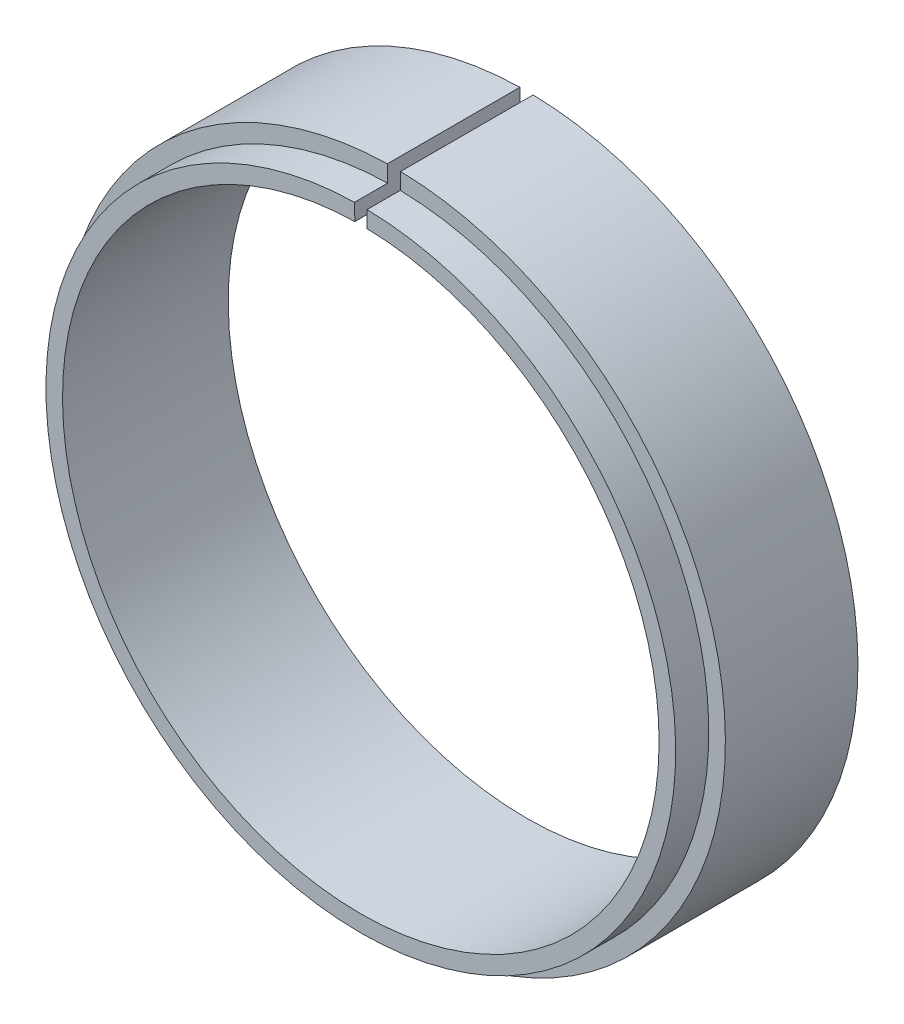
ISO-10303-21;
HEADER;
FILE_DESCRIPTION(('STEP AP214'),'2;1');
FILE_NAME('part.step','',(''),(''),'','','');
FILE_SCHEMA(('AUTOMOTIVE_DESIGN { 1 0 10303 214 1 1 1 1 }'));
ENDSEC;
DATA;
#1=APPLICATION_CONTEXT('core data for automotive mechanical design processes');
#2=APPLICATION_PROTOCOL_DEFINITION('international standard','automotive_design',2000,#1);
#3=PRODUCT_CONTEXT('',#1,'mechanical');
#4=PRODUCT('Part','Part','',(#3));
#5=PRODUCT_RELATED_PRODUCT_CATEGORY('part','',(#4));
#6=PRODUCT_DEFINITION_FORMATION('','',#4);
#7=PRODUCT_DEFINITION_CONTEXT('part definition',#1,'design');
#8=PRODUCT_DEFINITION('design','',#6,#7);
#9=PRODUCT_DEFINITION_SHAPE('','',#8);
#10=(LENGTH_UNIT() NAMED_UNIT(*) SI_UNIT(.MILLI.,.METRE.));
#11=(NAMED_UNIT(*) PLANE_ANGLE_UNIT() SI_UNIT($,.RADIAN.));
#12=(NAMED_UNIT(*) SI_UNIT($,.STERADIAN.) SOLID_ANGLE_UNIT());
#13=UNCERTAINTY_MEASURE_WITH_UNIT(LENGTH_MEASURE(1.E-05),#10,'distance_accuracy_value','');
#14=(GEOMETRIC_REPRESENTATION_CONTEXT(3) GLOBAL_UNCERTAINTY_ASSIGNED_CONTEXT((#13)) GLOBAL_UNIT_ASSIGNED_CONTEXT((#10,
#11,#12)) REPRESENTATION_CONTEXT('',''));
#15=CARTESIAN_POINT('',(0.,0.,0.));
#16=DIRECTION('',(0.,0.,1.));
#17=DIRECTION('',(1.,0.,0.));
#18=AXIS2_PLACEMENT_3D('',#15,#16,#17);
#19=CARTESIAN_POINT('',(0.,0.,20.));
#20=DIRECTION('',(0.,0.,-1.));
#21=DIRECTION('',(-1.,0.,0.));
#22=AXIS2_PLACEMENT_3D('',#19,#20,#21);
#23=CYLINDRICAL_SURFACE('',#22,45.);
#24=CARTESIAN_POINT('',(0.,0.,0.));
#25=DIRECTION('',(0.,0.,1.));
#26=DIRECTION('',(1.,0.,0.));
#27=AXIS2_PLACEMENT_3D('',#24,#25,#26);
#28=CIRCLE('',#27,45.);
#29=CARTESIAN_POINT('',(0.899999999999999,44.99099909982,0.));
#30=VERTEX_POINT('',#29);
#31=CARTESIAN_POINT('',(-0.899999999999983,44.99099909982,0.));
#32=VERTEX_POINT('',#31);
#33=EDGE_CURVE('E84',#30,#32,#28,.F.);
#34=ORIENTED_EDGE('',*,*,#33,.T.);
#35=DIRECTION('',(0.,0.,-1.));
#36=VECTOR('',#35,1.);
#37=CARTESIAN_POINT('',(-0.899999999999983,44.99099909982,20.));
#38=LINE('',#37,#36);
#39=CARTESIAN_POINT('',(-0.899999999999983,44.99099909982,25.));
#40=VERTEX_POINT('',#39);
#41=EDGE_CURVE('E11',#40,#32,#38,.T.);
#42=ORIENTED_EDGE('',*,*,#41,.F.);
#43=CARTESIAN_POINT('',(0.,0.,25.));
#44=DIRECTION('',(0.,0.,-1.));
#45=DIRECTION('',(1.,0.,0.));
#46=AXIS2_PLACEMENT_3D('',#43,#44,#45);
#47=CIRCLE('',#46,45.);
#48=CARTESIAN_POINT('',(0.899999999999999,44.99099909982,25.));
#49=VERTEX_POINT('',#48);
#50=EDGE_CURVE('E87',#49,#40,#47,.T.);
#51=ORIENTED_EDGE('',*,*,#50,.F.);
#52=DIRECTION('',(0.,0.,-1.));
#53=VECTOR('',#52,1.);
#54=CARTESIAN_POINT('',(0.899999999999999,44.99099909982,20.));
#55=LINE('',#54,#53);
#56=EDGE_CURVE('E81',#49,#30,#55,.T.);
#57=ORIENTED_EDGE('',*,*,#56,.T.);
#58=EDGE_LOOP('',(#34,#42,#51,#57));
#59=FACE_BOUND('',#58,.T.);
#60=ADVANCED_FACE('F38',(#59),#23,.F.);
#61=CARTESIAN_POINT('',(-0.999999999999976,49.9899989998,20.));
#62=DIRECTION('',(0.999799979995999,0.0199999999999986,0.));
#63=DIRECTION('',(-0.0199999999999986,0.999799979995999,0.));
#64=AXIS2_PLACEMENT_3D('',#61,#62,#63);
#65=PLANE('',#64);
#66=DIRECTION('',(0.0199999999999986,-0.999799979995999,0.));
#67=VECTOR('',#66,1.);
#68=CARTESIAN_POINT('',(-0.999999999999976,49.9899989998,0.));
#69=LINE('',#68,#67);
#70=CARTESIAN_POINT('',(-0.999999999999976,49.9899989998,0.));
#71=VERTEX_POINT('',#70);
#72=EDGE_CURVE('E99',#71,#32,#69,.T.);
#73=ORIENTED_EDGE('',*,*,#72,.F.);
#74=DIRECTION('',(0.,0.,-1.));
#75=VECTOR('',#74,1.);
#76=CARTESIAN_POINT('',(-0.999999999999976,49.9899989998,20.));
#77=LINE('',#76,#75);
#78=CARTESIAN_POINT('',(-0.999999999999976,49.9899989998,20.));
#79=VERTEX_POINT('',#78);
#80=EDGE_CURVE('E46',#79,#71,#77,.T.);
#81=ORIENTED_EDGE('',*,*,#80,.F.);
#82=DIRECTION('',(0.0199999999999986,-0.999799979995999,0.));
#83=VECTOR('',#82,1.);
#84=CARTESIAN_POINT('',(-0.999999999999976,49.9899989998,20.));
#85=LINE('',#84,#83);
#86=CARTESIAN_POINT('',(-0.94999999999998,47.49049904981,20.));
#87=VERTEX_POINT('',#86);
#88=EDGE_CURVE('E104',#79,#87,#85,.T.);
#89=ORIENTED_EDGE('',*,*,#88,.T.);
#90=DIRECTION('',(0.,0.,-1.));
#91=VECTOR('',#90,1.);
#92=CARTESIAN_POINT('',(-0.949999999999982,47.49049904981,25.));
#93=LINE('',#92,#91);
#94=CARTESIAN_POINT('',(-0.949999999999982,47.49049904981,25.));
#95=VERTEX_POINT('',#94);
#96=EDGE_CURVE('E100',#95,#87,#93,.T.);
#97=ORIENTED_EDGE('',*,*,#96,.F.);
#98=DIRECTION('',(-0.0199999999999996,0.999799979995999,0.));
#99=VECTOR('',#98,1.);
#100=CARTESIAN_POINT('',(-0.949999999999982,47.49049904981,25.));
#101=LINE('',#100,#99);
#102=EDGE_CURVE('E146',#40,#95,#101,.T.);
#103=ORIENTED_EDGE('',*,*,#102,.F.);
#104=ORIENTED_EDGE('',*,*,#41,.T.);
#105=EDGE_LOOP('',(#73,#81,#89,#97,#103,#104));
#106=FACE_BOUND('',#105,.T.);
#107=ADVANCED_FACE('F132',(#106),#65,.T.);
#108=CARTESIAN_POINT('',(0.,0.,20.));
#109=DIRECTION('',(0.,0.,-1.));
#110=DIRECTION('',(-1.,0.,0.));
#111=AXIS2_PLACEMENT_3D('',#108,#109,#110);
#112=CYLINDRICAL_SURFACE('',#111,50.);
#113=CARTESIAN_POINT('',(0.,0.,0.));
#114=DIRECTION('',(0.,0.,-1.));
#115=DIRECTION('',(-1.,0.,0.));
#116=AXIS2_PLACEMENT_3D('',#113,#114,#115);
#117=CIRCLE('',#116,50.);
#118=CARTESIAN_POINT('',(1.,49.9899989998,0.));
#119=VERTEX_POINT('',#118);
#120=EDGE_CURVE('E105',#119,#71,#117,.T.);
#121=ORIENTED_EDGE('',*,*,#120,.F.);
#122=DIRECTION('',(0.,0.,-1.));
#123=VECTOR('',#122,1.);
#124=CARTESIAN_POINT('',(1.,49.9899989998,20.));
#125=LINE('',#124,#123);
#126=CARTESIAN_POINT('',(1.,49.9899989998,20.));
#127=VERTEX_POINT('',#126);
#128=EDGE_CURVE('E91',#127,#119,#125,.T.);
#129=ORIENTED_EDGE('',*,*,#128,.F.);
#130=CARTESIAN_POINT('',(0.,0.,20.));
#131=DIRECTION('',(0.,0.,-1.));
#132=DIRECTION('',(-1.,0.,0.));
#133=AXIS2_PLACEMENT_3D('',#130,#131,#132);
#134=CIRCLE('',#133,50.);
#135=EDGE_CURVE('E107',#127,#79,#134,.T.);
#136=ORIENTED_EDGE('',*,*,#135,.T.);
#137=ORIENTED_EDGE('',*,*,#80,.T.);
#138=EDGE_LOOP('',(#121,#129,#136,#137));
#139=FACE_BOUND('',#138,.T.);
#140=ADVANCED_FACE('F126',(#139),#112,.T.);
#141=CARTESIAN_POINT('',(0.899999999999999,44.99099909982,20.));
#142=DIRECTION('',(-0.999799979995999,0.020000000000001,0.));
#143=DIRECTION('',(-0.020000000000001,-0.999799979995999,0.));
#144=AXIS2_PLACEMENT_3D('',#141,#142,#143);
#145=PLANE('',#144);
#146=DIRECTION('',(0.020000000000001,0.999799979995999,0.));
#147=VECTOR('',#146,1.);
#148=CARTESIAN_POINT('',(0.899999999999999,44.99099909982,0.));
#149=LINE('',#148,#147);
#150=EDGE_CURVE('E97',#30,#119,#149,.T.);
#151=ORIENTED_EDGE('',*,*,#150,.F.);
#152=ORIENTED_EDGE('',*,*,#56,.F.);
#153=DIRECTION('',(-0.0199999999999962,-0.999799979995999,0.));
#154=VECTOR('',#153,1.);
#155=CARTESIAN_POINT('',(0.899999999999999,44.99099909982,25.));
#156=LINE('',#155,#154);
#157=CARTESIAN_POINT('',(0.949999999999978,47.49049904981,25.));
#158=VERTEX_POINT('',#157);
#159=EDGE_CURVE('E142',#158,#49,#156,.T.);
#160=ORIENTED_EDGE('',*,*,#159,.F.);
#161=DIRECTION('',(0.,0.,-1.));
#162=VECTOR('',#161,1.);
#163=CARTESIAN_POINT('',(0.949999999999978,47.49049904981,25.));
#164=LINE('',#163,#162);
#165=CARTESIAN_POINT('',(0.949999999999978,47.49049904981,20.));
#166=VERTEX_POINT('',#165);
#167=EDGE_CURVE('E141',#158,#166,#164,.T.);
#168=ORIENTED_EDGE('',*,*,#167,.T.);
#169=DIRECTION('',(0.020000000000001,0.999799979995999,0.));
#170=VECTOR('',#169,1.);
#171=CARTESIAN_POINT('',(0.899999999999999,44.99099909982,20.));
#172=LINE('',#171,#170);
#173=EDGE_CURVE('E62',#166,#127,#172,.T.);
#174=ORIENTED_EDGE('',*,*,#173,.T.);
#175=ORIENTED_EDGE('',*,*,#128,.T.);
#176=EDGE_LOOP('',(#151,#152,#160,#168,#174,#175));
#177=FACE_BOUND('',#176,.T.);
#178=ADVANCED_FACE('F102',(#177),#145,.T.);
#179=CARTESIAN_POINT('',(0.,0.,20.));
#180=DIRECTION('',(0.,0.,1.));
#181=DIRECTION('',(1.,0.,0.));
#182=AXIS2_PLACEMENT_3D('',#179,#180,#181);
#183=PLANE('',#182);
#184=CARTESIAN_POINT('',(0.,0.,20.));
#185=DIRECTION('',(0.,0.,1.));
#186=DIRECTION('',(1.,0.,0.));
#187=AXIS2_PLACEMENT_3D('',#184,#185,#186);
#188=CIRCLE('',#187,47.5);
#189=EDGE_CURVE('E54',#87,#166,#188,.T.);
#190=ORIENTED_EDGE('',*,*,#189,.F.);
#191=ORIENTED_EDGE('',*,*,#88,.F.);
#192=ORIENTED_EDGE('',*,*,#135,.F.);
#193=ORIENTED_EDGE('',*,*,#173,.F.);
#194=EDGE_LOOP('',(#190,#191,#192,#193));
#195=FACE_BOUND('',#194,.T.);
#196=ADVANCED_FACE('F127',(#195),#183,.T.);
#197=CARTESIAN_POINT('',(0.,0.,0.));
#198=DIRECTION('',(0.,0.,1.));
#199=DIRECTION('',(1.,0.,0.));
#200=AXIS2_PLACEMENT_3D('',#197,#198,#199);
#201=PLANE('',#200);
#202=ORIENTED_EDGE('',*,*,#33,.F.);
#203=ORIENTED_EDGE('',*,*,#150,.T.);
#204=ORIENTED_EDGE('',*,*,#120,.T.);
#205=ORIENTED_EDGE('',*,*,#72,.T.);
#206=EDGE_LOOP('',(#202,#203,#204,#205));
#207=FACE_BOUND('',#206,.T.);
#208=ADVANCED_FACE('F95',(#207),#201,.F.);
#209=CARTESIAN_POINT('',(0.,0.,25.));
#210=DIRECTION('',(0.,0.,-1.));
#211=DIRECTION('',(-1.,0.,0.));
#212=AXIS2_PLACEMENT_3D('',#209,#210,#211);
#213=CYLINDRICAL_SURFACE('',#212,47.5);
#214=ORIENTED_EDGE('',*,*,#189,.T.);
#215=ORIENTED_EDGE('',*,*,#167,.F.);
#216=CARTESIAN_POINT('',(0.,0.,25.));
#217=DIRECTION('',(0.,0.,1.));
#218=DIRECTION('',(1.,0.,0.));
#219=AXIS2_PLACEMENT_3D('',#216,#217,#218);
#220=CIRCLE('',#219,47.5);
#221=EDGE_CURVE('E140',#95,#158,#220,.T.);
#222=ORIENTED_EDGE('',*,*,#221,.F.);
#223=ORIENTED_EDGE('',*,*,#96,.T.);
#224=EDGE_LOOP('',(#214,#215,#222,#223));
#225=FACE_BOUND('',#224,.T.);
#226=ADVANCED_FACE('F137',(#225),#213,.T.);
#227=CARTESIAN_POINT('',(0.,0.,25.));
#228=DIRECTION('',(0.,0.,1.));
#229=DIRECTION('',(1.,0.,0.));
#230=AXIS2_PLACEMENT_3D('',#227,#228,#229);
#231=PLANE('',#230);
#232=ORIENTED_EDGE('',*,*,#50,.T.);
#233=ORIENTED_EDGE('',*,*,#102,.T.);
#234=ORIENTED_EDGE('',*,*,#221,.T.);
#235=ORIENTED_EDGE('',*,*,#159,.T.);
#236=EDGE_LOOP('',(#232,#233,#234,#235));
#237=FACE_BOUND('',#236,.T.);
#238=ADVANCED_FACE('F153',(#237),#231,.T.);
#239=CLOSED_SHELL('',(#60,#107,#140,#178,#196,#208,#226,#238));
#240=MANIFOLD_SOLID_BREP('B2',#239);
#241=ADVANCED_BREP_SHAPE_REPRESENTATION('',(#18,#240),#14);
#242=SHAPE_DEFINITION_REPRESENTATION(#9,#241);
ENDSEC;
END-ISO-10303-21;
